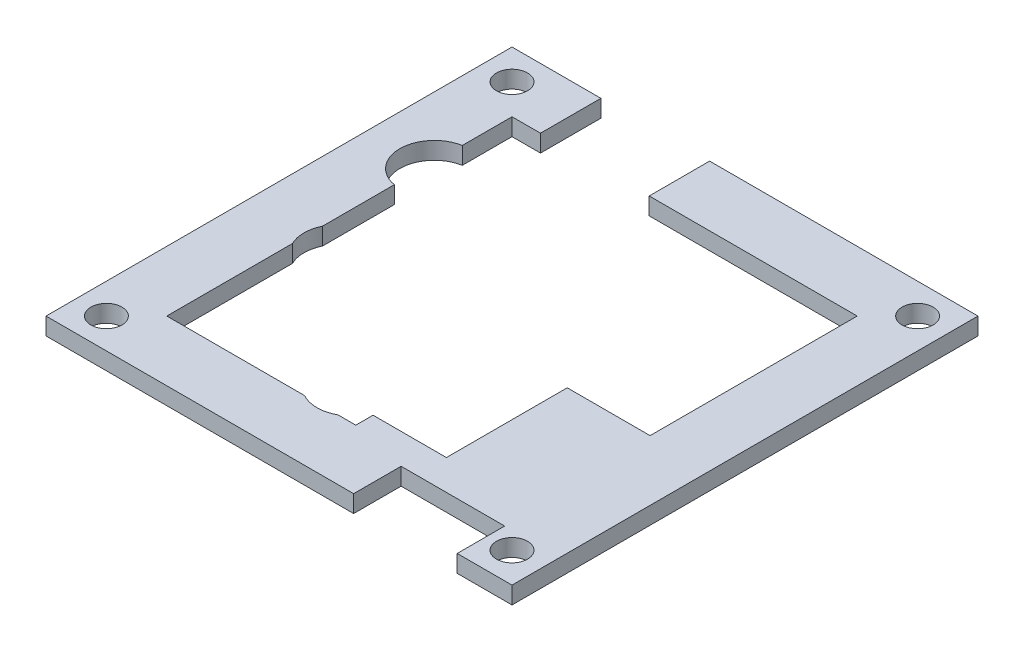
ISO-10303-21;
HEADER;
FILE_DESCRIPTION(('STEP AP214'),'2;1');
FILE_NAME('part.step','',(''),(''),'','','');
FILE_SCHEMA(('AUTOMOTIVE_DESIGN { 1 0 10303 214 1 1 1 1 }'));
ENDSEC;
DATA;
#1=APPLICATION_CONTEXT('core data for automotive mechanical design processes');
#2=APPLICATION_PROTOCOL_DEFINITION('international standard','automotive_design',2000,#1);
#3=PRODUCT_CONTEXT('',#1,'mechanical');
#4=PRODUCT('Part','Part','',(#3));
#5=PRODUCT_RELATED_PRODUCT_CATEGORY('part','',(#4));
#6=PRODUCT_DEFINITION_FORMATION('','',#4);
#7=PRODUCT_DEFINITION_CONTEXT('part definition',#1,'design');
#8=PRODUCT_DEFINITION('design','',#6,#7);
#9=PRODUCT_DEFINITION_SHAPE('','',#8);
#10=(LENGTH_UNIT() NAMED_UNIT(*) SI_UNIT(.MILLI.,.METRE.));
#11=(NAMED_UNIT(*) PLANE_ANGLE_UNIT() SI_UNIT($,.RADIAN.));
#12=(NAMED_UNIT(*) SI_UNIT($,.STERADIAN.) SOLID_ANGLE_UNIT());
#13=UNCERTAINTY_MEASURE_WITH_UNIT(LENGTH_MEASURE(1.E-05),#10,'distance_accuracy_value','');
#14=(GEOMETRIC_REPRESENTATION_CONTEXT(3) GLOBAL_UNCERTAINTY_ASSIGNED_CONTEXT((#13)) GLOBAL_UNIT_ASSIGNED_CONTEXT((#10,
#11,#12)) REPRESENTATION_CONTEXT('',''));
#15=CARTESIAN_POINT('',(0.,0.,0.));
#16=DIRECTION('',(0.,0.,1.));
#17=DIRECTION('',(1.,0.,0.));
#18=AXIS2_PLACEMENT_3D('',#15,#16,#17);
#19=CARTESIAN_POINT('',(10.4,2.,0.));
#20=DIRECTION('',(-1.,0.,0.));
#21=DIRECTION('',(0.,0.,1.));
#22=AXIS2_PLACEMENT_3D('',#19,#20,#21);
#23=PLANE('',#22);
#24=DIRECTION('',(0.,0.,-1.));
#25=VECTOR('',#24,1.);
#26=CARTESIAN_POINT('',(10.4,0.,0.));
#27=LINE('',#26,#25);
#28=CARTESIAN_POINT('',(10.4,0.,18.));
#29=VERTEX_POINT('',#28);
#30=CARTESIAN_POINT('',(10.4,0.,4.));
#31=VERTEX_POINT('',#30);
#32=EDGE_CURVE('E248',#29,#31,#27,.T.);
#33=ORIENTED_EDGE('',*,*,#32,.F.);
#34=DIRECTION('',(0.,-1.,0.));
#35=VECTOR('',#34,1.);
#36=CARTESIAN_POINT('',(10.4,2.,18.));
#37=LINE('',#36,#35);
#38=CARTESIAN_POINT('',(10.4,2.,18.));
#39=VERTEX_POINT('',#38);
#40=EDGE_CURVE('E11',#39,#29,#37,.T.);
#41=ORIENTED_EDGE('',*,*,#40,.F.);
#42=DIRECTION('',(0.,0.,-1.));
#43=VECTOR('',#42,1.);
#44=CARTESIAN_POINT('',(10.4,2.,0.));
#45=LINE('',#44,#43);
#46=CARTESIAN_POINT('',(10.4,2.,4.));
#47=VERTEX_POINT('',#46);
#48=EDGE_CURVE('E320',#39,#47,#45,.T.);
#49=ORIENTED_EDGE('',*,*,#48,.T.);
#50=DIRECTION('',(0.,-1.,0.));
#51=VECTOR('',#50,1.);
#52=CARTESIAN_POINT('',(10.4,2.,4.));
#53=LINE('',#52,#51);
#54=EDGE_CURVE('E51',#47,#31,#53,.T.);
#55=ORIENTED_EDGE('',*,*,#54,.T.);
#56=EDGE_LOOP('',(#33,#41,#49,#55));
#57=FACE_BOUND('',#56,.T.);
#58=ADVANCED_FACE('F35',(#57),#23,.T.);
#59=CARTESIAN_POINT('',(0.,2.,18.));
#60=DIRECTION('',(0.,0.,-1.));
#61=DIRECTION('',(-1.,0.,0.));
#62=AXIS2_PLACEMENT_3D('',#59,#60,#61);
#63=PLANE('',#62);
#64=DIRECTION('',(1.,0.,0.));
#65=VECTOR('',#64,1.);
#66=CARTESIAN_POINT('',(0.,0.,18.));
#67=LINE('',#66,#65);
#68=CARTESIAN_POINT('',(1.9,0.,18.));
#69=VERTEX_POINT('',#68);
#70=EDGE_CURVE('E250',#69,#29,#67,.T.);
#71=ORIENTED_EDGE('',*,*,#70,.F.);
#72=DIRECTION('',(0.,-1.,0.));
#73=VECTOR('',#72,1.);
#74=CARTESIAN_POINT('',(1.9,2.,18.));
#75=LINE('',#74,#73);
#76=CARTESIAN_POINT('',(1.9,2.,18.));
#77=VERTEX_POINT('',#76);
#78=EDGE_CURVE('E43',#77,#69,#75,.T.);
#79=ORIENTED_EDGE('',*,*,#78,.F.);
#80=DIRECTION('',(1.,0.,0.));
#81=VECTOR('',#80,1.);
#82=CARTESIAN_POINT('',(0.,2.,18.));
#83=LINE('',#82,#81);
#84=EDGE_CURVE('E395',#77,#39,#83,.T.);
#85=ORIENTED_EDGE('',*,*,#84,.T.);
#86=ORIENTED_EDGE('',*,*,#40,.T.);
#87=EDGE_LOOP('',(#71,#79,#85,#86));
#88=FACE_BOUND('',#87,.T.);
#89=ADVANCED_FACE('F381',(#88),#63,.T.);
#90=CARTESIAN_POINT('',(1.9,2.,0.));
#91=DIRECTION('',(-1.,0.,0.));
#92=DIRECTION('',(0.,0.,1.));
#93=AXIS2_PLACEMENT_3D('',#90,#91,#92);
#94=PLANE('',#93);
#95=DIRECTION('',(0.,0.,-1.));
#96=VECTOR('',#95,1.);
#97=CARTESIAN_POINT('',(1.9,0.,0.));
#98=LINE('',#97,#96);
#99=CARTESIAN_POINT('',(1.9,0.,20.));
#100=VERTEX_POINT('',#99);
#101=EDGE_CURVE('E253',#100,#69,#98,.T.);
#102=ORIENTED_EDGE('',*,*,#101,.F.);
#103=DIRECTION('',(0.,-1.,0.));
#104=VECTOR('',#103,1.);
#105=CARTESIAN_POINT('',(1.9,2.,20.));
#106=LINE('',#105,#104);
#107=CARTESIAN_POINT('',(1.9,2.,20.));
#108=VERTEX_POINT('',#107);
#109=EDGE_CURVE('E370',#108,#100,#106,.T.);
#110=ORIENTED_EDGE('',*,*,#109,.F.);
#111=DIRECTION('',(0.,0.,-1.));
#112=VECTOR('',#111,1.);
#113=CARTESIAN_POINT('',(1.9,2.,0.));
#114=LINE('',#113,#112);
#115=EDGE_CURVE('E377',#108,#77,#114,.T.);
#116=ORIENTED_EDGE('',*,*,#115,.T.);
#117=ORIENTED_EDGE('',*,*,#78,.T.);
#118=EDGE_LOOP('',(#102,#110,#116,#117));
#119=FACE_BOUND('',#118,.T.);
#120=ADVANCED_FACE('F375',(#119),#94,.T.);
#121=CARTESIAN_POINT('',(0.,2.,20.));
#122=DIRECTION('',(0.,0.,-1.));
#123=DIRECTION('',(-1.,0.,0.));
#124=AXIS2_PLACEMENT_3D('',#121,#122,#123);
#125=PLANE('',#124);
#126=DIRECTION('',(1.,0.,0.));
#127=VECTOR('',#126,1.);
#128=CARTESIAN_POINT('',(0.,0.,20.));
#129=LINE('',#128,#127);
#130=CARTESIAN_POINT('',(-0.163508326896289,0.,20.));
#131=VERTEX_POINT('',#130);
#132=EDGE_CURVE('E256',#131,#100,#129,.T.);
#133=ORIENTED_EDGE('',*,*,#132,.F.);
#134=DIRECTION('',(0.,-1.,0.));
#135=VECTOR('',#134,1.);
#136=CARTESIAN_POINT('',(-0.163508326896289,2.,20.));
#137=LINE('',#136,#135);
#138=CARTESIAN_POINT('',(-0.163508326896289,2.,20.));
#139=VERTEX_POINT('',#138);
#140=EDGE_CURVE('E368',#139,#131,#137,.T.);
#141=ORIENTED_EDGE('',*,*,#140,.F.);
#142=DIRECTION('',(1.,0.,0.));
#143=VECTOR('',#142,1.);
#144=CARTESIAN_POINT('',(0.,2.,20.));
#145=LINE('',#144,#143);
#146=EDGE_CURVE('E392',#139,#108,#145,.T.);
#147=ORIENTED_EDGE('',*,*,#146,.T.);
#148=ORIENTED_EDGE('',*,*,#109,.T.);
#149=EDGE_LOOP('',(#133,#141,#147,#148));
#150=FACE_BOUND('',#149,.T.);
#151=ADVANCED_FACE('F389',(#150),#125,.T.);
#152=CARTESIAN_POINT('',(-2.1,2.,16.5));
#153=DIRECTION('',(0.,-1.,0.));
#154=DIRECTION('',(0.,0.,-1.));
#155=AXIS2_PLACEMENT_3D('',#152,#153,#154);
#156=CYLINDRICAL_SURFACE('',#155,4.);
#157=CARTESIAN_POINT('',(-2.1,0.,16.5));
#158=DIRECTION('',(0.,1.,0.));
#159=DIRECTION('',(0.,0.,1.));
#160=AXIS2_PLACEMENT_3D('',#157,#158,#159);
#161=CIRCLE('',#160,4.);
#162=CARTESIAN_POINT('',(-4.03649167310371,0.,20.));
#163=VERTEX_POINT('',#162);
#164=EDGE_CURVE('E259',#163,#131,#161,.T.);
#165=ORIENTED_EDGE('',*,*,#164,.F.);
#166=DIRECTION('',(0.,-1.,0.));
#167=VECTOR('',#166,1.);
#168=CARTESIAN_POINT('',(-4.03649167310371,2.,20.));
#169=LINE('',#168,#167);
#170=CARTESIAN_POINT('',(-4.03649167310371,2.,20.));
#171=VERTEX_POINT('',#170);
#172=EDGE_CURVE('E366',#171,#163,#169,.T.);
#173=ORIENTED_EDGE('',*,*,#172,.F.);
#174=CARTESIAN_POINT('',(-2.1,2.,16.5));
#175=DIRECTION('',(0.,1.,0.));
#176=DIRECTION('',(0.,0.,1.));
#177=AXIS2_PLACEMENT_3D('',#174,#175,#176);
#178=CIRCLE('',#177,4.);
#179=EDGE_CURVE('E397',#171,#139,#178,.T.);
#180=ORIENTED_EDGE('',*,*,#179,.T.);
#181=ORIENTED_EDGE('',*,*,#140,.T.);
#182=EDGE_LOOP('',(#165,#173,#180,#181));
#183=FACE_BOUND('',#182,.T.);
#184=ADVANCED_FACE('F466',(#183),#156,.F.);
#185=CARTESIAN_POINT('',(-20.,0.,20.));
#186=VERTEX_POINT('',#185);
#187=EDGE_CURVE('E260',#186,#163,#129,.T.);
#188=ORIENTED_EDGE('',*,*,#187,.F.);
#189=DIRECTION('',(0.,-1.,0.));
#190=VECTOR('',#189,1.);
#191=CARTESIAN_POINT('',(-20.,2.,20.));
#192=LINE('',#191,#190);
#193=CARTESIAN_POINT('',(-20.,2.,20.));
#194=VERTEX_POINT('',#193);
#195=EDGE_CURVE('E364',#194,#186,#192,.T.);
#196=ORIENTED_EDGE('',*,*,#195,.F.);
#197=EDGE_CURVE('E399',#194,#171,#145,.T.);
#198=ORIENTED_EDGE('',*,*,#197,.T.);
#199=ORIENTED_EDGE('',*,*,#172,.T.);
#200=EDGE_LOOP('',(#188,#196,#198,#199));
#201=FACE_BOUND('',#200,.T.);
#202=ADVANCED_FACE('F469',(#201),#125,.T.);
#203=CARTESIAN_POINT('',(-20.,2.,0.));
#204=DIRECTION('',(1.,0.,0.));
#205=DIRECTION('',(0.,0.,-1.));
#206=AXIS2_PLACEMENT_3D('',#203,#204,#205);
#207=PLANE('',#206);
#208=DIRECTION('',(0.,0.,1.));
#209=VECTOR('',#208,1.);
#210=CARTESIAN_POINT('',(-20.,0.,0.));
#211=LINE('',#210,#209);
#212=CARTESIAN_POINT('',(-20.,0.,5.44355957741626));
#213=VERTEX_POINT('',#212);
#214=EDGE_CURVE('E263',#213,#186,#211,.T.);
#215=ORIENTED_EDGE('',*,*,#214,.F.);
#216=DIRECTION('',(0.,-1.,0.));
#217=VECTOR('',#216,1.);
#218=CARTESIAN_POINT('',(-20.,2.,5.44355957741626));
#219=LINE('',#218,#217);
#220=CARTESIAN_POINT('',(-20.,2.,5.44355957741626));
#221=VERTEX_POINT('',#220);
#222=EDGE_CURVE('E362',#221,#213,#219,.T.);
#223=ORIENTED_EDGE('',*,*,#222,.F.);
#224=DIRECTION('',(0.,0.,1.));
#225=VECTOR('',#224,1.);
#226=CARTESIAN_POINT('',(-20.,2.,0.));
#227=LINE('',#226,#225);
#228=EDGE_CURVE('E404',#221,#194,#227,.T.);
#229=ORIENTED_EDGE('',*,*,#228,.T.);
#230=ORIENTED_EDGE('',*,*,#195,.T.);
#231=EDGE_LOOP('',(#215,#223,#229,#230));
#232=FACE_BOUND('',#231,.T.);
#233=ADVANCED_FACE('F473',(#232),#207,.T.);
#234=CARTESIAN_POINT('',(-16.4,2.,3.7));
#235=DIRECTION('',(0.,-1.,0.));
#236=DIRECTION('',(0.,0.,-1.));
#237=AXIS2_PLACEMENT_3D('',#234,#235,#236);
#238=CYLINDRICAL_SURFACE('',#237,4.);
#239=CARTESIAN_POINT('',(-16.4,0.,3.7));
#240=DIRECTION('',(0.,1.,0.));
#241=DIRECTION('',(0.,0.,1.));
#242=AXIS2_PLACEMENT_3D('',#239,#240,#241);
#243=CIRCLE('',#242,4.);
#244=CARTESIAN_POINT('',(-20.,0.,1.95644042258373));
#245=VERTEX_POINT('',#244);
#246=EDGE_CURVE('E266',#245,#213,#243,.T.);
#247=ORIENTED_EDGE('',*,*,#246,.F.);
#248=DIRECTION('',(0.,-1.,0.));
#249=VECTOR('',#248,1.);
#250=CARTESIAN_POINT('',(-20.,2.,1.95644042258373));
#251=LINE('',#250,#249);
#252=CARTESIAN_POINT('',(-20.,2.,1.95644042258373));
#253=VERTEX_POINT('',#252);
#254=EDGE_CURVE('E360',#253,#245,#251,.T.);
#255=ORIENTED_EDGE('',*,*,#254,.F.);
#256=CARTESIAN_POINT('',(-16.4,2.,3.7));
#257=DIRECTION('',(0.,1.,0.));
#258=DIRECTION('',(0.,0.,1.));
#259=AXIS2_PLACEMENT_3D('',#256,#257,#258);
#260=CIRCLE('',#259,4.);
#261=EDGE_CURVE('E407',#253,#221,#260,.T.);
#262=ORIENTED_EDGE('',*,*,#261,.T.);
#263=ORIENTED_EDGE('',*,*,#222,.T.);
#264=EDGE_LOOP('',(#247,#255,#262,#263));
#265=FACE_BOUND('',#264,.T.);
#266=ADVANCED_FACE('F475',(#265),#238,.F.);
#267=CARTESIAN_POINT('',(-20.,0.,-6.36172626649696));
#268=VERTEX_POINT('',#267);
#269=EDGE_CURVE('E268',#268,#245,#211,.T.);
#270=ORIENTED_EDGE('',*,*,#269,.F.);
#271=DIRECTION('',(0.,-1.,0.));
#272=VECTOR('',#271,1.);
#273=CARTESIAN_POINT('',(-20.,2.,-6.36172626649696));
#274=LINE('',#273,#272);
#275=CARTESIAN_POINT('',(-20.,2.,-6.36172626649696));
#276=VERTEX_POINT('',#275);
#277=EDGE_CURVE('E358',#276,#268,#274,.T.);
#278=ORIENTED_EDGE('',*,*,#277,.F.);
#279=EDGE_CURVE('E409',#276,#253,#227,.T.);
#280=ORIENTED_EDGE('',*,*,#279,.T.);
#281=ORIENTED_EDGE('',*,*,#254,.T.);
#282=EDGE_LOOP('',(#270,#278,#280,#281));
#283=FACE_BOUND('',#282,.T.);
#284=ADVANCED_FACE('F478',(#283),#207,.T.);
#285=CARTESIAN_POINT('',(-19.3,2.,-10.3));
#286=DIRECTION('',(0.,-1.,0.));
#287=DIRECTION('',(0.,0.,-1.));
#288=AXIS2_PLACEMENT_3D('',#285,#286,#287);
#289=CYLINDRICAL_SURFACE('',#288,4.);
#290=CARTESIAN_POINT('',(-19.3,0.,-10.3));
#291=DIRECTION('',(0.,1.,0.));
#292=DIRECTION('',(0.,0.,1.));
#293=AXIS2_PLACEMENT_3D('',#290,#291,#292);
#294=CIRCLE('',#293,4.);
#295=CARTESIAN_POINT('',(-20.,0.,-14.238273733503));
#296=VERTEX_POINT('',#295);
#297=EDGE_CURVE('E271',#296,#268,#294,.T.);
#298=ORIENTED_EDGE('',*,*,#297,.F.);
#299=DIRECTION('',(0.,-1.,0.));
#300=VECTOR('',#299,1.);
#301=CARTESIAN_POINT('',(-20.,2.,-14.238273733503));
#302=LINE('',#301,#300);
#303=CARTESIAN_POINT('',(-20.,2.,-14.238273733503));
#304=VERTEX_POINT('',#303);
#305=EDGE_CURVE('E356',#304,#296,#302,.T.);
#306=ORIENTED_EDGE('',*,*,#305,.F.);
#307=CARTESIAN_POINT('',(-19.3,2.,-10.3));
#308=DIRECTION('',(0.,1.,0.));
#309=DIRECTION('',(0.,0.,1.));
#310=AXIS2_PLACEMENT_3D('',#307,#308,#309);
#311=CIRCLE('',#310,4.);
#312=EDGE_CURVE('E412',#304,#276,#311,.T.);
#313=ORIENTED_EDGE('',*,*,#312,.T.);
#314=ORIENTED_EDGE('',*,*,#277,.T.);
#315=EDGE_LOOP('',(#298,#306,#313,#314));
#316=FACE_BOUND('',#315,.T.);
#317=ADVANCED_FACE('F480',(#316),#289,.F.);
#318=CARTESIAN_POINT('',(-20.,0.,-20.));
#319=VERTEX_POINT('',#318);
#320=EDGE_CURVE('E267',#319,#296,#211,.T.);
#321=ORIENTED_EDGE('',*,*,#320,.F.);
#322=DIRECTION('',(0.,-1.,0.));
#323=VECTOR('',#322,1.);
#324=CARTESIAN_POINT('',(-20.,2.,-20.));
#325=LINE('',#324,#323);
#326=CARTESIAN_POINT('',(-20.,2.,-20.));
#327=VERTEX_POINT('',#326);
#328=EDGE_CURVE('E354',#327,#319,#325,.T.);
#329=ORIENTED_EDGE('',*,*,#328,.F.);
#330=EDGE_CURVE('E408',#327,#304,#227,.T.);
#331=ORIENTED_EDGE('',*,*,#330,.T.);
#332=ORIENTED_EDGE('',*,*,#305,.T.);
#333=EDGE_LOOP('',(#321,#329,#331,#332));
#334=FACE_BOUND('',#333,.T.);
#335=ADVANCED_FACE('F483',(#334),#207,.T.);
#336=CARTESIAN_POINT('',(0.,2.,-20.));
#337=DIRECTION('',(0.,0.,-1.));
#338=DIRECTION('',(-1.,0.,0.));
#339=AXIS2_PLACEMENT_3D('',#336,#337,#338);
#340=PLANE('',#339);
#341=DIRECTION('',(1.,0.,0.));
#342=VECTOR('',#341,1.);
#343=CARTESIAN_POINT('',(0.,0.,-20.));
#344=LINE('',#343,#342);
#345=CARTESIAN_POINT('',(-16.7,0.,-20.));
#346=VERTEX_POINT('',#345);
#347=EDGE_CURVE('E274',#319,#346,#344,.T.);
#348=ORIENTED_EDGE('',*,*,#347,.T.);
#349=DIRECTION('',(0.,-1.,0.));
#350=VECTOR('',#349,1.);
#351=CARTESIAN_POINT('',(-16.7,2.,-20.));
#352=LINE('',#351,#350);
#353=CARTESIAN_POINT('',(-16.7,2.,-20.));
#354=VERTEX_POINT('',#353);
#355=EDGE_CURVE('E351',#354,#346,#352,.T.);
#356=ORIENTED_EDGE('',*,*,#355,.F.);
#357=DIRECTION('',(1.,0.,0.));
#358=VECTOR('',#357,1.);
#359=CARTESIAN_POINT('',(0.,2.,-20.));
#360=LINE('',#359,#358);
#361=EDGE_CURVE('E415',#327,#354,#360,.T.);
#362=ORIENTED_EDGE('',*,*,#361,.F.);
#363=ORIENTED_EDGE('',*,*,#328,.T.);
#364=EDGE_LOOP('',(#348,#356,#362,#363));
#365=FACE_BOUND('',#364,.T.);
#366=ADVANCED_FACE('F487',(#365),#340,.F.);
#367=CARTESIAN_POINT('',(-16.7,2.,0.));
#368=DIRECTION('',(-1.,0.,0.));
#369=DIRECTION('',(0.,0.,1.));
#370=AXIS2_PLACEMENT_3D('',#367,#368,#369);
#371=PLANE('',#370);
#372=DIRECTION('',(0.,0.,-1.));
#373=VECTOR('',#372,1.);
#374=CARTESIAN_POINT('',(-16.7,0.,0.));
#375=LINE('',#374,#373);
#376=CARTESIAN_POINT('',(-16.7,0.,-27.));
#377=VERTEX_POINT('',#376);
#378=EDGE_CURVE('E276',#346,#377,#375,.T.);
#379=ORIENTED_EDGE('',*,*,#378,.T.);
#380=DIRECTION('',(0.,-1.,0.));
#381=VECTOR('',#380,1.);
#382=CARTESIAN_POINT('',(-16.7,2.,-27.));
#383=LINE('',#382,#381);
#384=CARTESIAN_POINT('',(-16.7,2.,-27.));
#385=VERTEX_POINT('',#384);
#386=EDGE_CURVE('E348',#385,#377,#383,.T.);
#387=ORIENTED_EDGE('',*,*,#386,.F.);
#388=DIRECTION('',(0.,0.,-1.));
#389=VECTOR('',#388,1.);
#390=CARTESIAN_POINT('',(-16.7,2.,0.));
#391=LINE('',#390,#389);
#392=EDGE_CURVE('E417',#354,#385,#391,.T.);
#393=ORIENTED_EDGE('',*,*,#392,.F.);
#394=ORIENTED_EDGE('',*,*,#355,.T.);
#395=EDGE_LOOP('',(#379,#387,#393,#394));
#396=FACE_BOUND('',#395,.T.);
#397=ADVANCED_FACE('F491',(#396),#371,.F.);
#398=CARTESIAN_POINT('',(0.,2.,-27.));
#399=DIRECTION('',(0.,0.,1.));
#400=DIRECTION('',(1.,0.,0.));
#401=AXIS2_PLACEMENT_3D('',#398,#399,#400);
#402=PLANE('',#401);
#403=DIRECTION('',(-1.,0.,0.));
#404=VECTOR('',#403,1.);
#405=CARTESIAN_POINT('',(0.,0.,-27.));
#406=LINE('',#405,#404);
#407=CARTESIAN_POINT('',(-27.,0.,-27.));
#408=VERTEX_POINT('',#407);
#409=EDGE_CURVE('E278',#377,#408,#406,.T.);
#410=ORIENTED_EDGE('',*,*,#409,.T.);
#411=DIRECTION('',(0.,-1.,0.));
#412=VECTOR('',#411,1.);
#413=CARTESIAN_POINT('',(-27.,2.,-27.));
#414=LINE('',#413,#412);
#415=CARTESIAN_POINT('',(-27.,2.,-27.));
#416=VERTEX_POINT('',#415);
#417=EDGE_CURVE('E345',#416,#408,#414,.T.);
#418=ORIENTED_EDGE('',*,*,#417,.F.);
#419=DIRECTION('',(-1.,0.,0.));
#420=VECTOR('',#419,1.);
#421=CARTESIAN_POINT('',(0.,2.,-27.));
#422=LINE('',#421,#420);
#423=EDGE_CURVE('E419',#385,#416,#422,.T.);
#424=ORIENTED_EDGE('',*,*,#423,.F.);
#425=ORIENTED_EDGE('',*,*,#386,.T.);
#426=EDGE_LOOP('',(#410,#418,#424,#425));
#427=FACE_BOUND('',#426,.T.);
#428=ADVANCED_FACE('F495',(#427),#402,.F.);
#429=CARTESIAN_POINT('',(-27.,2.,0.));
#430=DIRECTION('',(1.,0.,0.));
#431=DIRECTION('',(0.,0.,-1.));
#432=AXIS2_PLACEMENT_3D('',#429,#430,#431);
#433=PLANE('',#432);
#434=DIRECTION('',(0.,0.,1.));
#435=VECTOR('',#434,1.);
#436=CARTESIAN_POINT('',(-27.,0.,0.));
#437=LINE('',#436,#435);
#438=CARTESIAN_POINT('',(-27.,0.,27.));
#439=VERTEX_POINT('',#438);
#440=EDGE_CURVE('E280',#408,#439,#437,.T.);
#441=ORIENTED_EDGE('',*,*,#440,.T.);
#442=DIRECTION('',(0.,-1.,0.));
#443=VECTOR('',#442,1.);
#444=CARTESIAN_POINT('',(-27.,2.,27.));
#445=LINE('',#444,#443);
#446=CARTESIAN_POINT('',(-27.,2.,27.));
#447=VERTEX_POINT('',#446);
#448=EDGE_CURVE('E342',#447,#439,#445,.T.);
#449=ORIENTED_EDGE('',*,*,#448,.F.);
#450=DIRECTION('',(0.,0.,1.));
#451=VECTOR('',#450,1.);
#452=CARTESIAN_POINT('',(-27.,2.,0.));
#453=LINE('',#452,#451);
#454=EDGE_CURVE('E421',#416,#447,#453,.T.);
#455=ORIENTED_EDGE('',*,*,#454,.F.);
#456=ORIENTED_EDGE('',*,*,#417,.T.);
#457=EDGE_LOOP('',(#441,#449,#455,#456));
#458=FACE_BOUND('',#457,.T.);
#459=ADVANCED_FACE('F499',(#458),#433,.F.);
#460=CARTESIAN_POINT('',(0.,2.,27.));
#461=DIRECTION('',(0.,0.,-1.));
#462=DIRECTION('',(-1.,0.,0.));
#463=AXIS2_PLACEMENT_3D('',#460,#461,#462);
#464=PLANE('',#463);
#465=DIRECTION('',(1.,0.,0.));
#466=VECTOR('',#465,1.);
#467=CARTESIAN_POINT('',(0.,0.,27.));
#468=LINE('',#467,#466);
#469=CARTESIAN_POINT('',(8.65,0.,27.));
#470=VERTEX_POINT('',#469);
#471=EDGE_CURVE('E282',#439,#470,#468,.T.);
#472=ORIENTED_EDGE('',*,*,#471,.T.);
#473=DIRECTION('',(0.,-1.,0.));
#474=VECTOR('',#473,1.);
#475=CARTESIAN_POINT('',(8.65,2.,27.));
#476=LINE('',#475,#474);
#477=CARTESIAN_POINT('',(8.65,2.,27.));
#478=VERTEX_POINT('',#477);
#479=EDGE_CURVE('E340',#478,#470,#476,.T.);
#480=ORIENTED_EDGE('',*,*,#479,.F.);
#481=DIRECTION('',(1.,0.,0.));
#482=VECTOR('',#481,1.);
#483=CARTESIAN_POINT('',(0.,2.,27.));
#484=LINE('',#483,#482);
#485=EDGE_CURVE('E423',#447,#478,#484,.T.);
#486=ORIENTED_EDGE('',*,*,#485,.F.);
#487=ORIENTED_EDGE('',*,*,#448,.T.);
#488=EDGE_LOOP('',(#472,#480,#486,#487));
#489=FACE_BOUND('',#488,.T.);
#490=ADVANCED_FACE('F503',(#489),#464,.F.);
#491=CARTESIAN_POINT('',(8.65,2.,0.));
#492=DIRECTION('',(1.,0.,0.));
#493=DIRECTION('',(0.,0.,-1.));
#494=AXIS2_PLACEMENT_3D('',#491,#492,#493);
#495=PLANE('',#494);
#496=DIRECTION('',(0.,0.,1.));
#497=VECTOR('',#496,1.);
#498=CARTESIAN_POINT('',(8.65,0.,0.));
#499=LINE('',#498,#497);
#500=CARTESIAN_POINT('',(8.65,0.,21.5));
#501=VERTEX_POINT('',#500);
#502=EDGE_CURVE('E285',#501,#470,#499,.T.);
#503=ORIENTED_EDGE('',*,*,#502,.F.);
#504=DIRECTION('',(0.,-1.,0.));
#505=VECTOR('',#504,1.);
#506=CARTESIAN_POINT('',(8.65,2.,21.5));
#507=LINE('',#506,#505);
#508=CARTESIAN_POINT('',(8.65,2.,21.5));
#509=VERTEX_POINT('',#508);
#510=EDGE_CURVE('E338',#509,#501,#507,.T.);
#511=ORIENTED_EDGE('',*,*,#510,.F.);
#512=DIRECTION('',(0.,0.,1.));
#513=VECTOR('',#512,1.);
#514=CARTESIAN_POINT('',(8.65,2.,0.));
#515=LINE('',#514,#513);
#516=EDGE_CURVE('E425',#509,#478,#515,.T.);
#517=ORIENTED_EDGE('',*,*,#516,.T.);
#518=ORIENTED_EDGE('',*,*,#479,.T.);
#519=EDGE_LOOP('',(#503,#511,#517,#518));
#520=FACE_BOUND('',#519,.T.);
#521=ADVANCED_FACE('F507',(#520),#495,.T.);
#522=CARTESIAN_POINT('',(0.,2.,21.5));
#523=DIRECTION('',(0.,0.,-1.));
#524=DIRECTION('',(-1.,0.,0.));
#525=AXIS2_PLACEMENT_3D('',#522,#523,#524);
#526=PLANE('',#525);
#527=DIRECTION('',(1.,0.,0.));
#528=VECTOR('',#527,1.);
#529=CARTESIAN_POINT('',(0.,0.,21.5));
#530=LINE('',#529,#528);
#531=CARTESIAN_POINT('',(20.65,0.,21.5));
#532=VERTEX_POINT('',#531);
#533=EDGE_CURVE('E288',#501,#532,#530,.T.);
#534=ORIENTED_EDGE('',*,*,#533,.T.);
#535=DIRECTION('',(0.,-1.,0.));
#536=VECTOR('',#535,1.);
#537=CARTESIAN_POINT('',(20.65,2.,21.5));
#538=LINE('',#537,#536);
#539=CARTESIAN_POINT('',(20.65,2.,21.5));
#540=VERTEX_POINT('',#539);
#541=EDGE_CURVE('E335',#540,#532,#538,.T.);
#542=ORIENTED_EDGE('',*,*,#541,.F.);
#543=DIRECTION('',(1.,0.,0.));
#544=VECTOR('',#543,1.);
#545=CARTESIAN_POINT('',(0.,2.,21.5));
#546=LINE('',#545,#544);
#547=EDGE_CURVE('E428',#509,#540,#546,.T.);
#548=ORIENTED_EDGE('',*,*,#547,.F.);
#549=ORIENTED_EDGE('',*,*,#510,.T.);
#550=EDGE_LOOP('',(#534,#542,#548,#549));
#551=FACE_BOUND('',#550,.T.);
#552=ADVANCED_FACE('F511',(#551),#526,.F.);
#553=CARTESIAN_POINT('',(20.65,2.,0.));
#554=DIRECTION('',(1.,0.,0.));
#555=DIRECTION('',(0.,0.,-1.));
#556=AXIS2_PLACEMENT_3D('',#553,#554,#555);
#557=PLANE('',#556);
#558=DIRECTION('',(0.,0.,1.));
#559=VECTOR('',#558,1.);
#560=CARTESIAN_POINT('',(20.65,0.,0.));
#561=LINE('',#560,#559);
#562=CARTESIAN_POINT('',(20.65,0.,27.));
#563=VERTEX_POINT('',#562);
#564=EDGE_CURVE('E290',#532,#563,#561,.T.);
#565=ORIENTED_EDGE('',*,*,#564,.T.);
#566=DIRECTION('',(0.,-1.,0.));
#567=VECTOR('',#566,1.);
#568=CARTESIAN_POINT('',(20.65,2.,27.));
#569=LINE('',#568,#567);
#570=CARTESIAN_POINT('',(20.65,2.,27.));
#571=VERTEX_POINT('',#570);
#572=EDGE_CURVE('E332',#571,#563,#569,.T.);
#573=ORIENTED_EDGE('',*,*,#572,.F.);
#574=DIRECTION('',(0.,0.,1.));
#575=VECTOR('',#574,1.);
#576=CARTESIAN_POINT('',(20.65,2.,0.));
#577=LINE('',#576,#575);
#578=EDGE_CURVE('E430',#540,#571,#577,.T.);
#579=ORIENTED_EDGE('',*,*,#578,.F.);
#580=ORIENTED_EDGE('',*,*,#541,.T.);
#581=EDGE_LOOP('',(#565,#573,#579,#580));
#582=FACE_BOUND('',#581,.T.);
#583=ADVANCED_FACE('F515',(#582),#557,.F.);
#584=CARTESIAN_POINT('',(0.,2.,27.));
#585=DIRECTION('',(0.,0.,-1.));
#586=DIRECTION('',(-1.,0.,0.));
#587=AXIS2_PLACEMENT_3D('',#584,#585,#586);
#588=PLANE('',#587);
#589=DIRECTION('',(1.,0.,0.));
#590=VECTOR('',#589,1.);
#591=CARTESIAN_POINT('',(0.,0.,27.));
#592=LINE('',#591,#590);
#593=CARTESIAN_POINT('',(27.,0.,27.));
#594=VERTEX_POINT('',#593);
#595=EDGE_CURVE('E292',#563,#594,#592,.T.);
#596=ORIENTED_EDGE('',*,*,#595,.T.);
#597=DIRECTION('',(0.,-1.,0.));
#598=VECTOR('',#597,1.);
#599=CARTESIAN_POINT('',(27.,2.,27.));
#600=LINE('',#599,#598);
#601=CARTESIAN_POINT('',(27.,2.,27.));
#602=VERTEX_POINT('',#601);
#603=EDGE_CURVE('E329',#602,#594,#600,.T.);
#604=ORIENTED_EDGE('',*,*,#603,.F.);
#605=DIRECTION('',(1.,0.,0.));
#606=VECTOR('',#605,1.);
#607=CARTESIAN_POINT('',(0.,2.,27.));
#608=LINE('',#607,#606);
#609=EDGE_CURVE('E432',#571,#602,#608,.T.);
#610=ORIENTED_EDGE('',*,*,#609,.F.);
#611=ORIENTED_EDGE('',*,*,#572,.T.);
#612=EDGE_LOOP('',(#596,#604,#610,#611));
#613=FACE_BOUND('',#612,.T.);
#614=ADVANCED_FACE('F519',(#613),#588,.F.);
#615=CARTESIAN_POINT('',(27.,2.,0.));
#616=DIRECTION('',(-1.,0.,0.));
#617=DIRECTION('',(0.,0.,1.));
#618=AXIS2_PLACEMENT_3D('',#615,#616,#617);
#619=PLANE('',#618);
#620=DIRECTION('',(0.,0.,-1.));
#621=VECTOR('',#620,1.);
#622=CARTESIAN_POINT('',(27.,0.,0.));
#623=LINE('',#622,#621);
#624=CARTESIAN_POINT('',(27.,0.,-27.));
#625=VERTEX_POINT('',#624);
#626=EDGE_CURVE('E294',#594,#625,#623,.T.);
#627=ORIENTED_EDGE('',*,*,#626,.T.);
#628=DIRECTION('',(0.,-1.,0.));
#629=VECTOR('',#628,1.);
#630=CARTESIAN_POINT('',(27.,2.,-27.));
#631=LINE('',#630,#629);
#632=CARTESIAN_POINT('',(27.,2.,-27.));
#633=VERTEX_POINT('',#632);
#634=EDGE_CURVE('E326',#633,#625,#631,.T.);
#635=ORIENTED_EDGE('',*,*,#634,.F.);
#636=DIRECTION('',(0.,0.,-1.));
#637=VECTOR('',#636,1.);
#638=CARTESIAN_POINT('',(27.,2.,0.));
#639=LINE('',#638,#637);
#640=EDGE_CURVE('E434',#602,#633,#639,.T.);
#641=ORIENTED_EDGE('',*,*,#640,.F.);
#642=ORIENTED_EDGE('',*,*,#603,.T.);
#643=EDGE_LOOP('',(#627,#635,#641,#642));
#644=FACE_BOUND('',#643,.T.);
#645=ADVANCED_FACE('F523',(#644),#619,.F.);
#646=CARTESIAN_POINT('',(0.,2.,-27.));
#647=DIRECTION('',(0.,0.,1.));
#648=DIRECTION('',(1.,0.,0.));
#649=AXIS2_PLACEMENT_3D('',#646,#647,#648);
#650=PLANE('',#649);
#651=DIRECTION('',(-1.,0.,0.));
#652=VECTOR('',#651,1.);
#653=CARTESIAN_POINT('',(0.,0.,-27.));
#654=LINE('',#653,#652);
#655=CARTESIAN_POINT('',(-4.1,0.,-27.));
#656=VERTEX_POINT('',#655);
#657=EDGE_CURVE('E296',#625,#656,#654,.T.);
#658=ORIENTED_EDGE('',*,*,#657,.T.);
#659=DIRECTION('',(0.,-1.,0.));
#660=VECTOR('',#659,1.);
#661=CARTESIAN_POINT('',(-4.1,2.,-27.));
#662=LINE('',#661,#660);
#663=CARTESIAN_POINT('',(-4.1,2.,-27.));
#664=VERTEX_POINT('',#663);
#665=EDGE_CURVE('E324',#664,#656,#662,.T.);
#666=ORIENTED_EDGE('',*,*,#665,.F.);
#667=DIRECTION('',(-1.,0.,0.));
#668=VECTOR('',#667,1.);
#669=CARTESIAN_POINT('',(0.,2.,-27.));
#670=LINE('',#669,#668);
#671=EDGE_CURVE('E436',#633,#664,#670,.T.);
#672=ORIENTED_EDGE('',*,*,#671,.F.);
#673=ORIENTED_EDGE('',*,*,#634,.T.);
#674=EDGE_LOOP('',(#658,#666,#672,#673));
#675=FACE_BOUND('',#674,.T.);
#676=ADVANCED_FACE('F527',(#675),#650,.F.);
#677=CARTESIAN_POINT('',(-4.1,2.,0.));
#678=DIRECTION('',(-1.,0.,0.));
#679=DIRECTION('',(0.,0.,1.));
#680=AXIS2_PLACEMENT_3D('',#677,#678,#679);
#681=PLANE('',#680);
#682=DIRECTION('',(0.,0.,-1.));
#683=VECTOR('',#682,1.);
#684=CARTESIAN_POINT('',(-4.1,0.,0.));
#685=LINE('',#684,#683);
#686=CARTESIAN_POINT('',(-4.1,0.,-20.));
#687=VERTEX_POINT('',#686);
#688=EDGE_CURVE('E299',#687,#656,#685,.T.);
#689=ORIENTED_EDGE('',*,*,#688,.F.);
#690=DIRECTION('',(0.,-1.,0.));
#691=VECTOR('',#690,1.);
#692=CARTESIAN_POINT('',(-4.1,2.,-20.));
#693=LINE('',#692,#691);
#694=CARTESIAN_POINT('',(-4.1,2.,-20.));
#695=VERTEX_POINT('',#694);
#696=EDGE_CURVE('E228',#695,#687,#693,.T.);
#697=ORIENTED_EDGE('',*,*,#696,.F.);
#698=DIRECTION('',(0.,0.,-1.));
#699=VECTOR('',#698,1.);
#700=CARTESIAN_POINT('',(-4.1,2.,0.));
#701=LINE('',#700,#699);
#702=EDGE_CURVE('E218',#695,#664,#701,.T.);
#703=ORIENTED_EDGE('',*,*,#702,.T.);
#704=ORIENTED_EDGE('',*,*,#665,.T.);
#705=EDGE_LOOP('',(#689,#697,#703,#704));
#706=FACE_BOUND('',#705,.T.);
#707=ADVANCED_FACE('F439',(#706),#681,.T.);
#708=CARTESIAN_POINT('',(0.,2.,-20.));
#709=DIRECTION('',(0.,0.,-1.));
#710=DIRECTION('',(-1.,0.,0.));
#711=AXIS2_PLACEMENT_3D('',#708,#709,#710);
#712=PLANE('',#711);
#713=DIRECTION('',(1.,0.,0.));
#714=VECTOR('',#713,1.);
#715=CARTESIAN_POINT('',(0.,0.,-20.));
#716=LINE('',#715,#714);
#717=CARTESIAN_POINT('',(20.,0.,-20.));
#718=VERTEX_POINT('',#717);
#719=EDGE_CURVE('E225',#687,#718,#716,.T.);
#720=ORIENTED_EDGE('',*,*,#719,.T.);
#721=DIRECTION('',(0.,-1.,0.));
#722=VECTOR('',#721,1.);
#723=CARTESIAN_POINT('',(20.,2.,-20.));
#724=LINE('',#723,#722);
#725=CARTESIAN_POINT('',(20.,2.,-20.));
#726=VERTEX_POINT('',#725);
#727=EDGE_CURVE('E222',#726,#718,#724,.T.);
#728=ORIENTED_EDGE('',*,*,#727,.F.);
#729=DIRECTION('',(1.,0.,0.));
#730=VECTOR('',#729,1.);
#731=CARTESIAN_POINT('',(0.,2.,-20.));
#732=LINE('',#731,#730);
#733=EDGE_CURVE('E210',#695,#726,#732,.T.);
#734=ORIENTED_EDGE('',*,*,#733,.F.);
#735=ORIENTED_EDGE('',*,*,#696,.T.);
#736=EDGE_LOOP('',(#720,#728,#734,#735));
#737=FACE_BOUND('',#736,.T.);
#738=ADVANCED_FACE('F223',(#737),#712,.F.);
#739=CARTESIAN_POINT('',(20.,2.,0.));
#740=DIRECTION('',(-1.,0.,0.));
#741=DIRECTION('',(0.,0.,1.));
#742=AXIS2_PLACEMENT_3D('',#739,#740,#741);
#743=PLANE('',#742);
#744=DIRECTION('',(0.,0.,-1.));
#745=VECTOR('',#744,1.);
#746=CARTESIAN_POINT('',(20.,0.,0.));
#747=LINE('',#746,#745);
#748=CARTESIAN_POINT('',(20.,0.,4.));
#749=VERTEX_POINT('',#748);
#750=EDGE_CURVE('E303',#749,#718,#747,.T.);
#751=ORIENTED_EDGE('',*,*,#750,.F.);
#752=DIRECTION('',(0.,-1.,0.));
#753=VECTOR('',#752,1.);
#754=CARTESIAN_POINT('',(20.,2.,4.));
#755=LINE('',#754,#753);
#756=CARTESIAN_POINT('',(20.,2.,4.));
#757=VERTEX_POINT('',#756);
#758=EDGE_CURVE('E130',#757,#749,#755,.T.);
#759=ORIENTED_EDGE('',*,*,#758,.F.);
#760=DIRECTION('',(0.,0.,-1.));
#761=VECTOR('',#760,1.);
#762=CARTESIAN_POINT('',(20.,2.,0.));
#763=LINE('',#762,#761);
#764=EDGE_CURVE('E216',#757,#726,#763,.T.);
#765=ORIENTED_EDGE('',*,*,#764,.T.);
#766=ORIENTED_EDGE('',*,*,#727,.T.);
#767=EDGE_LOOP('',(#751,#759,#765,#766));
#768=FACE_BOUND('',#767,.T.);
#769=ADVANCED_FACE('F230',(#768),#743,.T.);
#770=CARTESIAN_POINT('',(-23.5,2.,-23.5));
#771=DIRECTION('',(0.,-1.,0.));
#772=DIRECTION('',(0.,0.,-1.));
#773=AXIS2_PLACEMENT_3D('',#770,#771,#772);
#774=CYLINDRICAL_SURFACE('',#773,1.8);
#775=CARTESIAN_POINT('',(-23.5,2.,-23.5));
#776=DIRECTION('',(0.,1.,0.));
#777=DIRECTION('',(0.,0.,1.));
#778=AXIS2_PLACEMENT_3D('',#775,#776,#777);
#779=CIRCLE('',#778,1.8);
#780=CARTESIAN_POINT('',(-23.5,2.,-21.7));
#781=VERTEX_POINT('',#780);
#782=EDGE_CURVE('E242',#781,#781,#779,.T.);
#783=ORIENTED_EDGE('',*,*,#782,.T.);
#784=EDGE_LOOP('',(#783));
#785=FACE_BOUND('',#784,.T.);
#786=CARTESIAN_POINT('',(-23.5,0.,-23.5));
#787=DIRECTION('',(0.,1.,0.));
#788=DIRECTION('',(0.,0.,1.));
#789=AXIS2_PLACEMENT_3D('',#786,#787,#788);
#790=CIRCLE('',#789,1.8);
#791=CARTESIAN_POINT('',(-23.5,0.,-21.7));
#792=VERTEX_POINT('',#791);
#793=EDGE_CURVE('E314',#792,#792,#790,.T.);
#794=ORIENTED_EDGE('',*,*,#793,.F.);
#795=EDGE_LOOP('',(#794));
#796=FACE_BOUND('',#795,.T.);
#797=ADVANCED_FACE('F536',(#785,#796),#774,.F.);
#798=CARTESIAN_POINT('',(23.5,2.,23.5));
#799=DIRECTION('',(0.,-1.,0.));
#800=DIRECTION('',(0.,0.,-1.));
#801=AXIS2_PLACEMENT_3D('',#798,#799,#800);
#802=CYLINDRICAL_SURFACE('',#801,1.8);
#803=CARTESIAN_POINT('',(23.5,2.,23.5));
#804=DIRECTION('',(0.,1.,0.));
#805=DIRECTION('',(0.,0.,1.));
#806=AXIS2_PLACEMENT_3D('',#803,#804,#805);
#807=CIRCLE('',#806,1.8);
#808=CARTESIAN_POINT('',(23.5,2.,25.3));
#809=VERTEX_POINT('',#808);
#810=EDGE_CURVE('E239',#809,#809,#807,.T.);
#811=ORIENTED_EDGE('',*,*,#810,.T.);
#812=EDGE_LOOP('',(#811));
#813=FACE_BOUND('',#812,.T.);
#814=CARTESIAN_POINT('',(23.5,0.,23.5));
#815=DIRECTION('',(0.,1.,0.));
#816=DIRECTION('',(0.,0.,1.));
#817=AXIS2_PLACEMENT_3D('',#814,#815,#816);
#818=CIRCLE('',#817,1.8);
#819=CARTESIAN_POINT('',(23.5,0.,25.3));
#820=VERTEX_POINT('',#819);
#821=EDGE_CURVE('E311',#820,#820,#818,.T.);
#822=ORIENTED_EDGE('',*,*,#821,.F.);
#823=EDGE_LOOP('',(#822));
#824=FACE_BOUND('',#823,.T.);
#825=ADVANCED_FACE('F453',(#813,#824),#802,.F.);
#826=CARTESIAN_POINT('',(23.5,2.,-23.5));
#827=DIRECTION('',(0.,-1.,0.));
#828=DIRECTION('',(0.,0.,-1.));
#829=AXIS2_PLACEMENT_3D('',#826,#827,#828);
#830=CYLINDRICAL_SURFACE('',#829,1.8);
#831=CARTESIAN_POINT('',(23.5,2.,-23.5));
#832=DIRECTION('',(0.,1.,0.));
#833=DIRECTION('',(0.,0.,1.));
#834=AXIS2_PLACEMENT_3D('',#831,#832,#833);
#835=CIRCLE('',#834,1.8);
#836=CARTESIAN_POINT('',(23.5,2.,-21.7));
#837=VERTEX_POINT('',#836);
#838=EDGE_CURVE('E233',#837,#837,#835,.T.);
#839=ORIENTED_EDGE('',*,*,#838,.T.);
#840=EDGE_LOOP('',(#839));
#841=FACE_BOUND('',#840,.T.);
#842=CARTESIAN_POINT('',(23.5,0.,-23.5));
#843=DIRECTION('',(0.,1.,0.));
#844=DIRECTION('',(0.,0.,1.));
#845=AXIS2_PLACEMENT_3D('',#842,#843,#844);
#846=CIRCLE('',#845,1.8);
#847=CARTESIAN_POINT('',(23.5,0.,-21.7));
#848=VERTEX_POINT('',#847);
#849=EDGE_CURVE('E308',#848,#848,#846,.T.);
#850=ORIENTED_EDGE('',*,*,#849,.F.);
#851=EDGE_LOOP('',(#850));
#852=FACE_BOUND('',#851,.T.);
#853=ADVANCED_FACE('F445',(#841,#852),#830,.F.);
#854=CARTESIAN_POINT('',(0.,2.,4.));
#855=DIRECTION('',(0.,0.,-1.));
#856=DIRECTION('',(-1.,0.,0.));
#857=AXIS2_PLACEMENT_3D('',#854,#855,#856);
#858=PLANE('',#857);
#859=DIRECTION('',(1.,0.,0.));
#860=VECTOR('',#859,1.);
#861=CARTESIAN_POINT('',(0.,0.,4.));
#862=LINE('',#861,#860);
#863=EDGE_CURVE('E305',#31,#749,#862,.T.);
#864=ORIENTED_EDGE('',*,*,#863,.F.);
#865=ORIENTED_EDGE('',*,*,#54,.F.);
#866=DIRECTION('',(1.,0.,0.));
#867=VECTOR('',#866,1.);
#868=CARTESIAN_POINT('',(0.,2.,4.));
#869=LINE('',#868,#867);
#870=EDGE_CURVE('E231',#47,#757,#869,.T.);
#871=ORIENTED_EDGE('',*,*,#870,.T.);
#872=ORIENTED_EDGE('',*,*,#758,.T.);
#873=EDGE_LOOP('',(#864,#865,#871,#872));
#874=FACE_BOUND('',#873,.T.);
#875=ADVANCED_FACE('F442',(#874),#858,.T.);
#876=CARTESIAN_POINT('',(-23.5,2.,23.5));
#877=DIRECTION('',(0.,-1.,0.));
#878=DIRECTION('',(0.,0.,-1.));
#879=AXIS2_PLACEMENT_3D('',#876,#877,#878);
#880=CYLINDRICAL_SURFACE('',#879,1.8);
#881=CARTESIAN_POINT('',(-23.5,2.,23.5));
#882=DIRECTION('',(0.,1.,0.));
#883=DIRECTION('',(0.,0.,1.));
#884=AXIS2_PLACEMENT_3D('',#881,#882,#883);
#885=CIRCLE('',#884,1.8);
#886=CARTESIAN_POINT('',(-23.5,2.,25.3));
#887=VERTEX_POINT('',#886);
#888=EDGE_CURVE('E245',#887,#887,#885,.T.);
#889=ORIENTED_EDGE('',*,*,#888,.T.);
#890=EDGE_LOOP('',(#889));
#891=FACE_BOUND('',#890,.T.);
#892=CARTESIAN_POINT('',(-23.5,0.,23.5));
#893=DIRECTION('',(0.,1.,0.));
#894=DIRECTION('',(0.,0.,1.));
#895=AXIS2_PLACEMENT_3D('',#892,#893,#894);
#896=CIRCLE('',#895,1.8);
#897=CARTESIAN_POINT('',(-23.5,0.,25.3));
#898=VERTEX_POINT('',#897);
#899=EDGE_CURVE('E317',#898,#898,#896,.T.);
#900=ORIENTED_EDGE('',*,*,#899,.F.);
#901=EDGE_LOOP('',(#900));
#902=FACE_BOUND('',#901,.T.);
#903=ADVANCED_FACE('F444',(#891,#902),#880,.F.);
#904=CARTESIAN_POINT('',(0.,2.,0.));
#905=DIRECTION('',(0.,1.,0.));
#906=DIRECTION('',(0.,0.,1.));
#907=AXIS2_PLACEMENT_3D('',#904,#905,#906);
#908=PLANE('',#907);
#909=ORIENTED_EDGE('',*,*,#48,.F.);
#910=ORIENTED_EDGE('',*,*,#84,.F.);
#911=ORIENTED_EDGE('',*,*,#115,.F.);
#912=ORIENTED_EDGE('',*,*,#146,.F.);
#913=ORIENTED_EDGE('',*,*,#179,.F.);
#914=ORIENTED_EDGE('',*,*,#197,.F.);
#915=ORIENTED_EDGE('',*,*,#228,.F.);
#916=ORIENTED_EDGE('',*,*,#261,.F.);
#917=ORIENTED_EDGE('',*,*,#279,.F.);
#918=ORIENTED_EDGE('',*,*,#312,.F.);
#919=ORIENTED_EDGE('',*,*,#330,.F.);
#920=ORIENTED_EDGE('',*,*,#361,.T.);
#921=ORIENTED_EDGE('',*,*,#392,.T.);
#922=ORIENTED_EDGE('',*,*,#423,.T.);
#923=ORIENTED_EDGE('',*,*,#454,.T.);
#924=ORIENTED_EDGE('',*,*,#485,.T.);
#925=ORIENTED_EDGE('',*,*,#516,.F.);
#926=ORIENTED_EDGE('',*,*,#547,.T.);
#927=ORIENTED_EDGE('',*,*,#578,.T.);
#928=ORIENTED_EDGE('',*,*,#609,.T.);
#929=ORIENTED_EDGE('',*,*,#640,.T.);
#930=ORIENTED_EDGE('',*,*,#671,.T.);
#931=ORIENTED_EDGE('',*,*,#702,.F.);
#932=ORIENTED_EDGE('',*,*,#733,.T.);
#933=ORIENTED_EDGE('',*,*,#764,.F.);
#934=ORIENTED_EDGE('',*,*,#870,.F.);
#935=EDGE_LOOP('',(#909,#910,#911,#912,#913,#914,#915,#916,#917,#918,#919,#920,#921,#922,#923,
#924,#925,#926,#927,#928,#929,#930,#931,#932,#933,#934));
#936=FACE_BOUND('',#935,.T.);
#937=ORIENTED_EDGE('',*,*,#838,.F.);
#938=EDGE_LOOP('',(#937));
#939=FACE_BOUND('',#938,.T.);
#940=ORIENTED_EDGE('',*,*,#810,.F.);
#941=EDGE_LOOP('',(#940));
#942=FACE_BOUND('',#941,.T.);
#943=ORIENTED_EDGE('',*,*,#782,.F.);
#944=EDGE_LOOP('',(#943));
#945=FACE_BOUND('',#944,.T.);
#946=ORIENTED_EDGE('',*,*,#888,.F.);
#947=EDGE_LOOP('',(#946));
#948=FACE_BOUND('',#947,.T.);
#949=ADVANCED_FACE('F212',(#936,#939,#942,#945,#948),#908,.T.);
#950=CARTESIAN_POINT('',(0.,0.,0.));
#951=DIRECTION('',(0.,1.,0.));
#952=DIRECTION('',(0.,0.,1.));
#953=AXIS2_PLACEMENT_3D('',#950,#951,#952);
#954=PLANE('',#953);
#955=ORIENTED_EDGE('',*,*,#32,.T.);
#956=ORIENTED_EDGE('',*,*,#863,.T.);
#957=ORIENTED_EDGE('',*,*,#750,.T.);
#958=ORIENTED_EDGE('',*,*,#719,.F.);
#959=ORIENTED_EDGE('',*,*,#688,.T.);
#960=ORIENTED_EDGE('',*,*,#657,.F.);
#961=ORIENTED_EDGE('',*,*,#626,.F.);
#962=ORIENTED_EDGE('',*,*,#595,.F.);
#963=ORIENTED_EDGE('',*,*,#564,.F.);
#964=ORIENTED_EDGE('',*,*,#533,.F.);
#965=ORIENTED_EDGE('',*,*,#502,.T.);
#966=ORIENTED_EDGE('',*,*,#471,.F.);
#967=ORIENTED_EDGE('',*,*,#440,.F.);
#968=ORIENTED_EDGE('',*,*,#409,.F.);
#969=ORIENTED_EDGE('',*,*,#378,.F.);
#970=ORIENTED_EDGE('',*,*,#347,.F.);
#971=ORIENTED_EDGE('',*,*,#320,.T.);
#972=ORIENTED_EDGE('',*,*,#297,.T.);
#973=ORIENTED_EDGE('',*,*,#269,.T.);
#974=ORIENTED_EDGE('',*,*,#246,.T.);
#975=ORIENTED_EDGE('',*,*,#214,.T.);
#976=ORIENTED_EDGE('',*,*,#187,.T.);
#977=ORIENTED_EDGE('',*,*,#164,.T.);
#978=ORIENTED_EDGE('',*,*,#132,.T.);
#979=ORIENTED_EDGE('',*,*,#101,.T.);
#980=ORIENTED_EDGE('',*,*,#70,.T.);
#981=EDGE_LOOP('',(#955,#956,#957,#958,#959,#960,#961,#962,#963,#964,#965,#966,#967,#968,#969,
#970,#971,#972,#973,#974,#975,#976,#977,#978,#979,#980));
#982=FACE_BOUND('',#981,.T.);
#983=ORIENTED_EDGE('',*,*,#849,.T.);
#984=EDGE_LOOP('',(#983));
#985=FACE_BOUND('',#984,.T.);
#986=ORIENTED_EDGE('',*,*,#821,.T.);
#987=EDGE_LOOP('',(#986));
#988=FACE_BOUND('',#987,.T.);
#989=ORIENTED_EDGE('',*,*,#793,.T.);
#990=EDGE_LOOP('',(#989));
#991=FACE_BOUND('',#990,.T.);
#992=ORIENTED_EDGE('',*,*,#899,.T.);
#993=EDGE_LOOP('',(#992));
#994=FACE_BOUND('',#993,.T.);
#995=ADVANCED_FACE('F383',(#982,#985,#988,#991,#994),#954,.F.);
#996=CLOSED_SHELL('',(#58,#89,#120,#151,#184,#202,#233,#266,#284,#317,#335,#366,#397,#428,#459,
#490,#521,#552,#583,#614,#645,#676,#707,#738,#769,#797,#825,#853,#875,#903,#949,#995));
#997=MANIFOLD_SOLID_BREP('B2',#996);
#998=ADVANCED_BREP_SHAPE_REPRESENTATION('',(#18,#997),#14);
#999=SHAPE_DEFINITION_REPRESENTATION(#9,#998);
ENDSEC;
END-ISO-10303-21;
